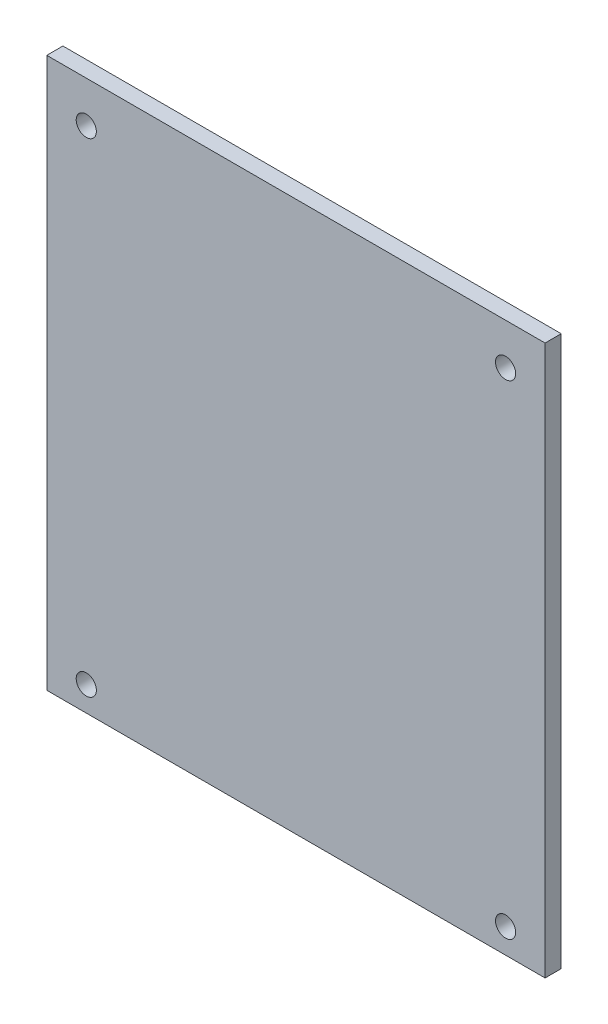
ISO-10303-21;
HEADER;
FILE_DESCRIPTION(('STEP AP214'),'2;1');
FILE_NAME('part.step','',(''),(''),'','','');
FILE_SCHEMA(('AUTOMOTIVE_DESIGN { 1 0 10303 214 1 1 1 1 }'));
ENDSEC;
DATA;
#1=APPLICATION_CONTEXT('core data for automotive mechanical design processes');
#2=APPLICATION_PROTOCOL_DEFINITION('international standard','automotive_design',2000,#1);
#3=PRODUCT_CONTEXT('',#1,'mechanical');
#4=PRODUCT('Part','Part','',(#3));
#5=PRODUCT_RELATED_PRODUCT_CATEGORY('part','',(#4));
#6=PRODUCT_DEFINITION_FORMATION('','',#4);
#7=PRODUCT_DEFINITION_CONTEXT('part definition',#1,'design');
#8=PRODUCT_DEFINITION('design','',#6,#7);
#9=PRODUCT_DEFINITION_SHAPE('','',#8);
#10=(LENGTH_UNIT() NAMED_UNIT(*) SI_UNIT(.MILLI.,.METRE.));
#11=(NAMED_UNIT(*) PLANE_ANGLE_UNIT() SI_UNIT($,.RADIAN.));
#12=(NAMED_UNIT(*) SI_UNIT($,.STERADIAN.) SOLID_ANGLE_UNIT());
#13=UNCERTAINTY_MEASURE_WITH_UNIT(LENGTH_MEASURE(1.E-05),#10,'distance_accuracy_value','');
#14=(GEOMETRIC_REPRESENTATION_CONTEXT(3) GLOBAL_UNCERTAINTY_ASSIGNED_CONTEXT((#13)) GLOBAL_UNIT_ASSIGNED_CONTEXT((#10,
#11,#12)) REPRESENTATION_CONTEXT('',''));
#15=CARTESIAN_POINT('',(0.,0.,0.));
#16=DIRECTION('',(0.,0.,1.));
#17=DIRECTION('',(1.,0.,0.));
#18=AXIS2_PLACEMENT_3D('',#15,#16,#17);
#19=CARTESIAN_POINT('',(0.,86.614,2.54));
#20=DIRECTION('',(1.,0.,0.));
#21=DIRECTION('',(0.,1.,0.));
#22=AXIS2_PLACEMENT_3D('',#19,#20,#21);
#23=PLANE('',#22);
#24=DIRECTION('',(0.,-1.,0.));
#25=VECTOR('',#24,1.);
#26=CARTESIAN_POINT('',(0.,86.614,0.));
#27=LINE('',#26,#25);
#28=CARTESIAN_POINT('',(0.,86.614,0.));
#29=VERTEX_POINT('',#28);
#30=CARTESIAN_POINT('',(0.,0.,0.));
#31=VERTEX_POINT('',#30);
#32=EDGE_CURVE('E96',#29,#31,#27,.T.);
#33=ORIENTED_EDGE('',*,*,#32,.T.);
#34=DIRECTION('',(0.,0.,-1.));
#35=VECTOR('',#34,1.);
#36=CARTESIAN_POINT('',(0.,0.,2.54));
#37=LINE('',#36,#35);
#38=CARTESIAN_POINT('',(0.,0.,2.54));
#39=VERTEX_POINT('',#38);
#40=EDGE_CURVE('E11',#39,#31,#37,.T.);
#41=ORIENTED_EDGE('',*,*,#40,.F.);
#42=DIRECTION('',(0.,-1.,0.));
#43=VECTOR('',#42,1.);
#44=CARTESIAN_POINT('',(0.,86.614,2.54));
#45=LINE('',#44,#43);
#46=CARTESIAN_POINT('',(0.,86.614,2.54));
#47=VERTEX_POINT('',#46);
#48=EDGE_CURVE('E84',#47,#39,#45,.T.);
#49=ORIENTED_EDGE('',*,*,#48,.F.);
#50=DIRECTION('',(0.,0.,-1.));
#51=VECTOR('',#50,1.);
#52=CARTESIAN_POINT('',(0.,86.614,2.54));
#53=LINE('',#52,#51);
#54=EDGE_CURVE('E92',#47,#29,#53,.T.);
#55=ORIENTED_EDGE('',*,*,#54,.T.);
#56=EDGE_LOOP('',(#33,#41,#49,#55));
#57=FACE_BOUND('',#56,.T.);
#58=ADVANCED_FACE('F33',(#57),#23,.F.);
#59=CARTESIAN_POINT('',(0.,0.,2.54));
#60=DIRECTION('',(0.,1.,0.));
#61=DIRECTION('',(-1.,0.,0.));
#62=AXIS2_PLACEMENT_3D('',#59,#60,#61);
#63=PLANE('',#62);
#64=DIRECTION('',(1.,0.,0.));
#65=VECTOR('',#64,1.);
#66=CARTESIAN_POINT('',(0.,0.,0.));
#67=LINE('',#66,#65);
#68=CARTESIAN_POINT('',(78.486,0.,0.));
#69=VERTEX_POINT('',#68);
#70=EDGE_CURVE('E88',#31,#69,#67,.T.);
#71=ORIENTED_EDGE('',*,*,#70,.T.);
#72=DIRECTION('',(0.,0.,-1.));
#73=VECTOR('',#72,1.);
#74=CARTESIAN_POINT('',(78.486,0.,2.54));
#75=LINE('',#74,#73);
#76=CARTESIAN_POINT('',(78.486,0.,2.54));
#77=VERTEX_POINT('',#76);
#78=EDGE_CURVE('E41',#77,#69,#75,.T.);
#79=ORIENTED_EDGE('',*,*,#78,.F.);
#80=DIRECTION('',(1.,0.,0.));
#81=VECTOR('',#80,1.);
#82=CARTESIAN_POINT('',(0.,0.,2.54));
#83=LINE('',#82,#81);
#84=EDGE_CURVE('E79',#39,#77,#83,.T.);
#85=ORIENTED_EDGE('',*,*,#84,.F.);
#86=ORIENTED_EDGE('',*,*,#40,.T.);
#87=EDGE_LOOP('',(#71,#79,#85,#86));
#88=FACE_BOUND('',#87,.T.);
#89=ADVANCED_FACE('F87',(#88),#63,.F.);
#90=CARTESIAN_POINT('',(78.486,86.614,2.54));
#91=DIRECTION('',(-1.,0.,0.));
#92=DIRECTION('',(0.,-1.,0.));
#93=AXIS2_PLACEMENT_3D('',#90,#91,#92);
#94=PLANE('',#93);
#95=DIRECTION('',(0.,1.,0.));
#96=VECTOR('',#95,1.);
#97=CARTESIAN_POINT('',(78.486,86.614,0.));
#98=LINE('',#97,#96);
#99=CARTESIAN_POINT('',(78.486,86.614,0.));
#100=VERTEX_POINT('',#99);
#101=EDGE_CURVE('E66',#69,#100,#98,.T.);
#102=ORIENTED_EDGE('',*,*,#101,.T.);
#103=DIRECTION('',(0.,0.,-1.));
#104=VECTOR('',#103,1.);
#105=CARTESIAN_POINT('',(78.486,86.614,2.54));
#106=LINE('',#105,#104);
#107=CARTESIAN_POINT('',(78.486,86.614,2.54));
#108=VERTEX_POINT('',#107);
#109=EDGE_CURVE('E89',#108,#100,#106,.T.);
#110=ORIENTED_EDGE('',*,*,#109,.F.);
#111=DIRECTION('',(0.,1.,0.));
#112=VECTOR('',#111,1.);
#113=CARTESIAN_POINT('',(78.486,86.614,2.54));
#114=LINE('',#113,#112);
#115=EDGE_CURVE('E82',#77,#108,#114,.T.);
#116=ORIENTED_EDGE('',*,*,#115,.F.);
#117=ORIENTED_EDGE('',*,*,#78,.T.);
#118=EDGE_LOOP('',(#102,#110,#116,#117));
#119=FACE_BOUND('',#118,.T.);
#120=ADVANCED_FACE('F90',(#119),#94,.F.);
#121=CARTESIAN_POINT('',(0.,86.614,2.54));
#122=DIRECTION('',(0.,-1.,0.));
#123=DIRECTION('',(1.,0.,0.));
#124=AXIS2_PLACEMENT_3D('',#121,#122,#123);
#125=PLANE('',#124);
#126=DIRECTION('',(-1.,0.,0.));
#127=VECTOR('',#126,1.);
#128=CARTESIAN_POINT('',(0.,86.614,0.));
#129=LINE('',#128,#127);
#130=EDGE_CURVE('E72',#100,#29,#129,.T.);
#131=ORIENTED_EDGE('',*,*,#130,.T.);
#132=ORIENTED_EDGE('',*,*,#54,.F.);
#133=DIRECTION('',(-1.,0.,0.));
#134=VECTOR('',#133,1.);
#135=CARTESIAN_POINT('',(0.,86.614,2.54));
#136=LINE('',#135,#134);
#137=EDGE_CURVE('E49',#108,#47,#136,.T.);
#138=ORIENTED_EDGE('',*,*,#137,.F.);
#139=ORIENTED_EDGE('',*,*,#109,.T.);
#140=EDGE_LOOP('',(#131,#132,#138,#139));
#141=FACE_BOUND('',#140,.T.);
#142=ADVANCED_FACE('F104',(#141),#125,.F.);
#143=CARTESIAN_POINT('',(0.,0.,2.54));
#144=DIRECTION('',(0.,0.,1.));
#145=DIRECTION('',(1.,0.,0.));
#146=AXIS2_PLACEMENT_3D('',#143,#144,#145);
#147=PLANE('',#146);
#148=CARTESIAN_POINT('',(6.22300000000004,3.91159999999997,2.54));
#149=DIRECTION('',(0.,0.,1.));
#150=DIRECTION('',(1.,0.,0.));
#151=AXIS2_PLACEMENT_3D('',#148,#149,#150);
#152=CIRCLE('',#151,1.58749999999999);
#153=CARTESIAN_POINT('',(7.81050000000003,3.91159999999997,2.54));
#154=VERTEX_POINT('',#153);
#155=EDGE_CURVE('E120',#154,#154,#152,.T.);
#156=ORIENTED_EDGE('',*,*,#155,.F.);
#157=EDGE_LOOP('',(#156));
#158=FACE_BOUND('',#157,.T.);
#159=CARTESIAN_POINT('',(72.263,3.91160000000003,2.54));
#160=DIRECTION('',(0.,0.,1.));
#161=DIRECTION('',(1.,0.,0.));
#162=AXIS2_PLACEMENT_3D('',#159,#160,#161);
#163=CIRCLE('',#162,1.5875);
#164=CARTESIAN_POINT('',(73.8505000000001,3.91160000000003,2.54));
#165=VERTEX_POINT('',#164);
#166=EDGE_CURVE('E119',#165,#165,#163,.T.);
#167=ORIENTED_EDGE('',*,*,#166,.F.);
#168=EDGE_LOOP('',(#167));
#169=FACE_BOUND('',#168,.T.);
#170=CARTESIAN_POINT('',(72.263,80.1116,2.54));
#171=DIRECTION('',(0.,0.,1.));
#172=DIRECTION('',(1.,0.,0.));
#173=AXIS2_PLACEMENT_3D('',#170,#171,#172);
#174=CIRCLE('',#173,1.58749999999999);
#175=CARTESIAN_POINT('',(73.8505,80.1116,2.54));
#176=VERTEX_POINT('',#175);
#177=EDGE_CURVE('E126',#176,#176,#174,.T.);
#178=ORIENTED_EDGE('',*,*,#177,.F.);
#179=EDGE_LOOP('',(#178));
#180=FACE_BOUND('',#179,.T.);
#181=CARTESIAN_POINT('',(6.22299999999997,80.1116,2.54));
#182=DIRECTION('',(0.,0.,1.));
#183=DIRECTION('',(1.,0.,0.));
#184=AXIS2_PLACEMENT_3D('',#181,#182,#183);
#185=CIRCLE('',#184,1.58749999999999);
#186=CARTESIAN_POINT('',(7.81049999999997,80.1116,2.54));
#187=VERTEX_POINT('',#186);
#188=EDGE_CURVE('E112',#187,#187,#185,.T.);
#189=ORIENTED_EDGE('',*,*,#188,.F.);
#190=EDGE_LOOP('',(#189));
#191=FACE_BOUND('',#190,.T.);
#192=ORIENTED_EDGE('',*,*,#48,.T.);
#193=ORIENTED_EDGE('',*,*,#84,.T.);
#194=ORIENTED_EDGE('',*,*,#115,.T.);
#195=ORIENTED_EDGE('',*,*,#137,.T.);
#196=EDGE_LOOP('',(#192,#193,#194,#195));
#197=FACE_BOUND('',#196,.T.);
#198=ADVANCED_FACE('F80',(#158,#169,#180,#191,#197),#147,.T.);
#199=CARTESIAN_POINT('',(0.,0.,0.));
#200=DIRECTION('',(0.,0.,1.));
#201=DIRECTION('',(1.,0.,0.));
#202=AXIS2_PLACEMENT_3D('',#199,#200,#201);
#203=PLANE('',#202);
#204=CARTESIAN_POINT('',(6.22300000000004,3.91159999999997,0.));
#205=DIRECTION('',(0.,0.,1.));
#206=DIRECTION('',(1.,0.,0.));
#207=AXIS2_PLACEMENT_3D('',#204,#205,#206);
#208=CIRCLE('',#207,1.58749999999999);
#209=CARTESIAN_POINT('',(7.81050000000003,3.91159999999997,0.));
#210=VERTEX_POINT('',#209);
#211=EDGE_CURVE('E116',#210,#210,#208,.F.);
#212=ORIENTED_EDGE('',*,*,#211,.F.);
#213=EDGE_LOOP('',(#212));
#214=FACE_BOUND('',#213,.T.);
#215=CARTESIAN_POINT('',(72.263,3.91160000000003,0.));
#216=DIRECTION('',(0.,0.,1.));
#217=DIRECTION('',(1.,0.,0.));
#218=AXIS2_PLACEMENT_3D('',#215,#216,#217);
#219=CIRCLE('',#218,1.5875);
#220=CARTESIAN_POINT('',(73.8505000000001,3.91160000000003,0.));
#221=VERTEX_POINT('',#220);
#222=EDGE_CURVE('E123',#221,#221,#219,.F.);
#223=ORIENTED_EDGE('',*,*,#222,.F.);
#224=EDGE_LOOP('',(#223));
#225=FACE_BOUND('',#224,.T.);
#226=CARTESIAN_POINT('',(72.263,80.1116,0.));
#227=DIRECTION('',(0.,0.,1.));
#228=DIRECTION('',(1.,0.,0.));
#229=AXIS2_PLACEMENT_3D('',#226,#227,#228);
#230=CIRCLE('',#229,1.58749999999999);
#231=CARTESIAN_POINT('',(73.8505,80.1116,0.));
#232=VERTEX_POINT('',#231);
#233=EDGE_CURVE('E115',#232,#232,#230,.F.);
#234=ORIENTED_EDGE('',*,*,#233,.F.);
#235=EDGE_LOOP('',(#234));
#236=FACE_BOUND('',#235,.T.);
#237=CARTESIAN_POINT('',(6.22299999999997,80.1116,0.));
#238=DIRECTION('',(0.,0.,1.));
#239=DIRECTION('',(1.,0.,0.));
#240=AXIS2_PLACEMENT_3D('',#237,#238,#239);
#241=CIRCLE('',#240,1.58749999999999);
#242=CARTESIAN_POINT('',(7.81049999999997,80.1116,0.));
#243=VERTEX_POINT('',#242);
#244=EDGE_CURVE('E99',#243,#243,#241,.F.);
#245=ORIENTED_EDGE('',*,*,#244,.F.);
#246=EDGE_LOOP('',(#245));
#247=FACE_BOUND('',#246,.T.);
#248=ORIENTED_EDGE('',*,*,#32,.F.);
#249=ORIENTED_EDGE('',*,*,#130,.F.);
#250=ORIENTED_EDGE('',*,*,#101,.F.);
#251=ORIENTED_EDGE('',*,*,#70,.F.);
#252=EDGE_LOOP('',(#248,#249,#250,#251));
#253=FACE_BOUND('',#252,.T.);
#254=ADVANCED_FACE('F107',(#214,#225,#236,#247,#253),#203,.F.);
#255=CARTESIAN_POINT('',(6.22299999999997,80.1116,-4.49012806053458));
#256=DIRECTION('',(0.,0.,1.));
#257=DIRECTION('',(1.,0.,0.));
#258=AXIS2_PLACEMENT_3D('',#255,#256,#257);
#259=CYLINDRICAL_SURFACE('',#258,1.58749999999999);
#260=ORIENTED_EDGE('',*,*,#244,.T.);
#261=EDGE_LOOP('',(#260));
#262=FACE_BOUND('',#261,.T.);
#263=ORIENTED_EDGE('',*,*,#188,.T.);
#264=EDGE_LOOP('',(#263));
#265=FACE_BOUND('',#264,.T.);
#266=ADVANCED_FACE('F142',(#262,#265),#259,.F.);
#267=CARTESIAN_POINT('',(72.263,80.1116,-4.49012806053458));
#268=DIRECTION('',(0.,0.,1.));
#269=DIRECTION('',(1.,0.,0.));
#270=AXIS2_PLACEMENT_3D('',#267,#268,#269);
#271=CYLINDRICAL_SURFACE('',#270,1.58749999999999);
#272=ORIENTED_EDGE('',*,*,#233,.T.);
#273=EDGE_LOOP('',(#272));
#274=FACE_BOUND('',#273,.T.);
#275=ORIENTED_EDGE('',*,*,#177,.T.);
#276=EDGE_LOOP('',(#275));
#277=FACE_BOUND('',#276,.T.);
#278=ADVANCED_FACE('F134',(#274,#277),#271,.F.);
#279=CARTESIAN_POINT('',(72.263,3.91160000000003,-4.49012806053458));
#280=DIRECTION('',(0.,0.,1.));
#281=DIRECTION('',(1.,0.,0.));
#282=AXIS2_PLACEMENT_3D('',#279,#280,#281);
#283=CYLINDRICAL_SURFACE('',#282,1.5875);
#284=ORIENTED_EDGE('',*,*,#222,.T.);
#285=EDGE_LOOP('',(#284));
#286=FACE_BOUND('',#285,.T.);
#287=ORIENTED_EDGE('',*,*,#166,.T.);
#288=EDGE_LOOP('',(#287));
#289=FACE_BOUND('',#288,.T.);
#290=ADVANCED_FACE('F150',(#286,#289),#283,.F.);
#291=CARTESIAN_POINT('',(6.22300000000004,3.91159999999997,-4.49012806053458));
#292=DIRECTION('',(0.,0.,1.));
#293=DIRECTION('',(1.,0.,0.));
#294=AXIS2_PLACEMENT_3D('',#291,#292,#293);
#295=CYLINDRICAL_SURFACE('',#294,1.58749999999999);
#296=ORIENTED_EDGE('',*,*,#211,.T.);
#297=EDGE_LOOP('',(#296));
#298=FACE_BOUND('',#297,.T.);
#299=ORIENTED_EDGE('',*,*,#155,.T.);
#300=EDGE_LOOP('',(#299));
#301=FACE_BOUND('',#300,.T.);
#302=ADVANCED_FACE('F197',(#298,#301),#295,.F.);
#303=CLOSED_SHELL('',(#58,#89,#120,#142,#198,#254,#266,#278,#290,#302));
#304=MANIFOLD_SOLID_BREP('B2',#303);
#305=ADVANCED_BREP_SHAPE_REPRESENTATION('',(#18,#304),#14);
#306=SHAPE_DEFINITION_REPRESENTATION(#9,#305);
ENDSEC;
END-ISO-10303-21;
